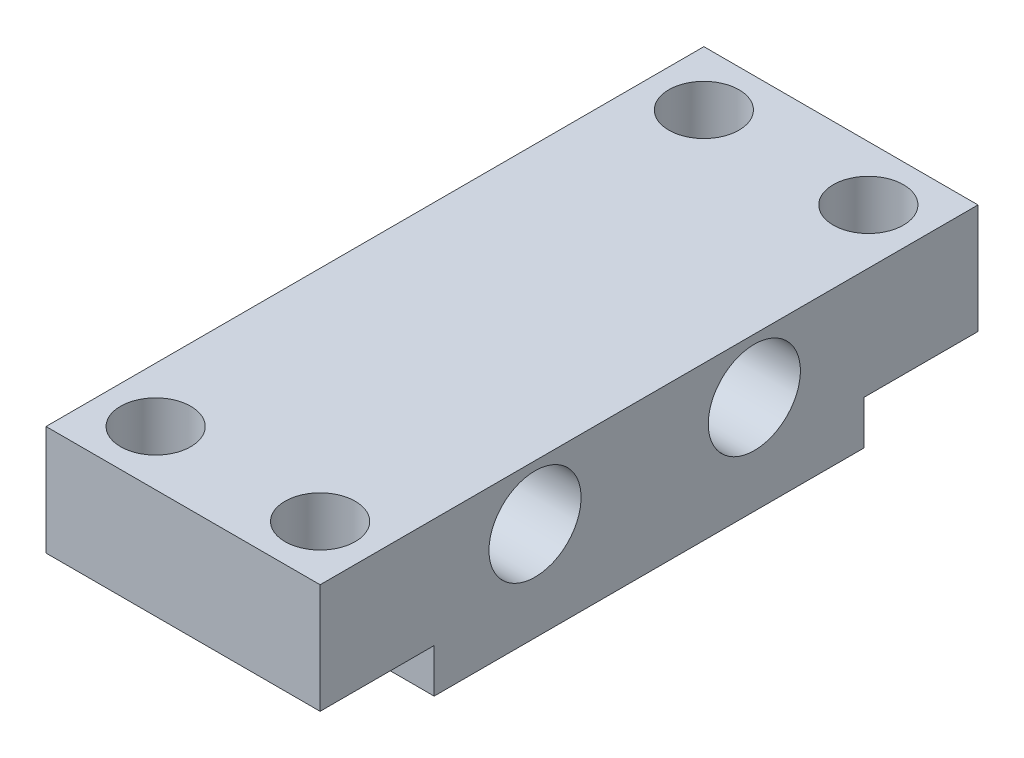
ISO-10303-21;
HEADER;
FILE_DESCRIPTION(('STEP AP214'),'2;1');
FILE_NAME('part.step','',(''),(''),'','','');
FILE_SCHEMA(('AUTOMOTIVE_DESIGN { 1 0 10303 214 1 1 1 1 }'));
ENDSEC;
DATA;
#1=APPLICATION_CONTEXT('core data for automotive mechanical design processes');
#2=APPLICATION_PROTOCOL_DEFINITION('international standard','automotive_design',2000,#1);
#3=PRODUCT_CONTEXT('',#1,'mechanical');
#4=PRODUCT('Part','Part','',(#3));
#5=PRODUCT_RELATED_PRODUCT_CATEGORY('part','',(#4));
#6=PRODUCT_DEFINITION_FORMATION('','',#4);
#7=PRODUCT_DEFINITION_CONTEXT('part definition',#1,'design');
#8=PRODUCT_DEFINITION('design','',#6,#7);
#9=PRODUCT_DEFINITION_SHAPE('','',#8);
#10=(LENGTH_UNIT() NAMED_UNIT(*) SI_UNIT(.MILLI.,.METRE.));
#11=(NAMED_UNIT(*) PLANE_ANGLE_UNIT() SI_UNIT($,.RADIAN.));
#12=(NAMED_UNIT(*) SI_UNIT($,.STERADIAN.) SOLID_ANGLE_UNIT());
#13=UNCERTAINTY_MEASURE_WITH_UNIT(LENGTH_MEASURE(1.E-05),#10,'distance_accuracy_value','');
#14=(GEOMETRIC_REPRESENTATION_CONTEXT(3) GLOBAL_UNCERTAINTY_ASSIGNED_CONTEXT((#13)) GLOBAL_UNIT_ASSIGNED_CONTEXT((#10,
#11,#12)) REPRESENTATION_CONTEXT('',''));
#15=CARTESIAN_POINT('',(0.,0.,0.));
#16=DIRECTION('',(0.,0.,1.));
#17=DIRECTION('',(1.,0.,0.));
#18=AXIS2_PLACEMENT_3D('',#15,#16,#17);
#19=CARTESIAN_POINT('',(0.,0.,0.));
#20=DIRECTION('',(0.,-1.,0.));
#21=DIRECTION('',(0.,0.,-1.));
#22=AXIS2_PLACEMENT_3D('',#19,#20,#21);
#23=PLANE('',#22);
#24=CARTESIAN_POINT('',(10.,0.,-2.5));
#25=DIRECTION('',(0.,-1.,0.));
#26=DIRECTION('',(0.,0.,-1.));
#27=AXIS2_PLACEMENT_3D('',#24,#25,#26);
#28=CIRCLE('',#27,1.6);
#29=CARTESIAN_POINT('',(10.,0.,-4.1));
#30=VERTEX_POINT('',#29);
#31=EDGE_CURVE('E178',#30,#30,#28,.T.);
#32=ORIENTED_EDGE('',*,*,#31,.F.);
#33=EDGE_LOOP('',(#32));
#34=FACE_BOUND('',#33,.T.);
#35=CARTESIAN_POINT('',(2.5,0.,-2.5));
#36=DIRECTION('',(0.,-1.,0.));
#37=DIRECTION('',(0.,0.,-1.));
#38=AXIS2_PLACEMENT_3D('',#35,#36,#37);
#39=CIRCLE('',#38,1.6);
#40=CARTESIAN_POINT('',(2.5,0.,-4.1));
#41=VERTEX_POINT('',#40);
#42=EDGE_CURVE('E165',#41,#41,#39,.T.);
#43=ORIENTED_EDGE('',*,*,#42,.F.);
#44=EDGE_LOOP('',(#43));
#45=FACE_BOUND('',#44,.T.);
#46=DIRECTION('',(-1.,0.,0.));
#47=VECTOR('',#46,1.);
#48=CARTESIAN_POINT('',(0.,0.,-5.2));
#49=LINE('',#48,#47);
#50=CARTESIAN_POINT('',(12.5,0.,-5.2));
#51=VERTEX_POINT('',#50);
#52=CARTESIAN_POINT('',(0.,0.,-5.2));
#53=VERTEX_POINT('',#52);
#54=EDGE_CURVE('E53',#51,#53,#49,.T.);
#55=ORIENTED_EDGE('',*,*,#54,.F.);
#56=DIRECTION('',(0.,0.,-1.));
#57=VECTOR('',#56,1.);
#58=CARTESIAN_POINT('',(12.5,0.,0.));
#59=LINE('',#58,#57);
#60=CARTESIAN_POINT('',(12.5,0.,0.));
#61=VERTEX_POINT('',#60);
#62=EDGE_CURVE('E147',#61,#51,#59,.T.);
#63=ORIENTED_EDGE('',*,*,#62,.F.);
#64=DIRECTION('',(1.,0.,0.));
#65=VECTOR('',#64,1.);
#66=CARTESIAN_POINT('',(0.,0.,0.));
#67=LINE('',#66,#65);
#68=CARTESIAN_POINT('',(0.,0.,0.));
#69=VERTEX_POINT('',#68);
#70=EDGE_CURVE('E144',#69,#61,#67,.T.);
#71=ORIENTED_EDGE('',*,*,#70,.F.);
#72=DIRECTION('',(0.,0.,1.));
#73=VECTOR('',#72,1.);
#74=CARTESIAN_POINT('',(0.,0.,0.));
#75=LINE('',#74,#73);
#76=EDGE_CURVE('E58',#53,#69,#75,.T.);
#77=ORIENTED_EDGE('',*,*,#76,.F.);
#78=EDGE_LOOP('',(#55,#63,#71,#77));
#79=FACE_BOUND('',#78,.T.);
#80=ADVANCED_FACE('F36',(#34,#45,#79),#23,.T.);
#81=CARTESIAN_POINT('',(0.,5.,0.));
#82=DIRECTION('',(1.,0.,0.));
#83=DIRECTION('',(0.,0.,-1.));
#84=AXIS2_PLACEMENT_3D('',#81,#82,#83);
#85=PLANE('',#84);
#86=CARTESIAN_POINT('',(0.,2.5,-19.8));
#87=DIRECTION('',(-1.,0.,0.));
#88=DIRECTION('',(0.,0.,1.));
#89=AXIS2_PLACEMENT_3D('',#86,#87,#88);
#90=CIRCLE('',#89,2.1);
#91=CARTESIAN_POINT('',(0.,2.5,-17.7));
#92=VERTEX_POINT('',#91);
#93=EDGE_CURVE('E160',#92,#92,#90,.T.);
#94=ORIENTED_EDGE('',*,*,#93,.F.);
#95=EDGE_LOOP('',(#94));
#96=FACE_BOUND('',#95,.T.);
#97=CARTESIAN_POINT('',(0.,2.5,-9.8));
#98=DIRECTION('',(-1.,0.,0.));
#99=DIRECTION('',(0.,0.,1.));
#100=AXIS2_PLACEMENT_3D('',#97,#98,#99);
#101=CIRCLE('',#100,2.1);
#102=CARTESIAN_POINT('',(0.,2.5,-7.7));
#103=VERTEX_POINT('',#102);
#104=EDGE_CURVE('E170',#103,#103,#101,.T.);
#105=ORIENTED_EDGE('',*,*,#104,.F.);
#106=EDGE_LOOP('',(#105));
#107=FACE_BOUND('',#106,.T.);
#108=CARTESIAN_POINT('',(0.,0.,-30.));
#109=VERTEX_POINT('',#108);
#110=CARTESIAN_POINT('',(0.,0.,-24.8));
#111=VERTEX_POINT('',#110);
#112=EDGE_CURVE('E126',#109,#111,#75,.T.);
#113=ORIENTED_EDGE('',*,*,#112,.T.);
#114=DIRECTION('',(0.,1.,0.));
#115=VECTOR('',#114,1.);
#116=CARTESIAN_POINT('',(0.,-2.,-24.8));
#117=LINE('',#116,#115);
#118=CARTESIAN_POINT('',(0.,-2.,-24.8));
#119=VERTEX_POINT('',#118);
#120=EDGE_CURVE('E107',#119,#111,#117,.T.);
#121=ORIENTED_EDGE('',*,*,#120,.F.);
#122=DIRECTION('',(0.,0.,-1.));
#123=VECTOR('',#122,1.);
#124=CARTESIAN_POINT('',(0.,-2.,-5.2));
#125=LINE('',#124,#123);
#126=CARTESIAN_POINT('',(0.,-2.,-5.2));
#127=VERTEX_POINT('',#126);
#128=EDGE_CURVE('E113',#127,#119,#125,.T.);
#129=ORIENTED_EDGE('',*,*,#128,.F.);
#130=DIRECTION('',(0.,1.,0.));
#131=VECTOR('',#130,1.);
#132=CARTESIAN_POINT('',(0.,-2.,-5.2));
#133=LINE('',#132,#131);
#134=EDGE_CURVE('E189',#127,#53,#133,.T.);
#135=ORIENTED_EDGE('',*,*,#134,.T.);
#136=ORIENTED_EDGE('',*,*,#76,.T.);
#137=DIRECTION('',(0.,-1.,0.));
#138=VECTOR('',#137,1.);
#139=CARTESIAN_POINT('',(0.,5.,0.));
#140=LINE('',#139,#138);
#141=CARTESIAN_POINT('',(0.,5.,0.));
#142=VERTEX_POINT('',#141);
#143=EDGE_CURVE('E11',#142,#69,#140,.T.);
#144=ORIENTED_EDGE('',*,*,#143,.F.);
#145=DIRECTION('',(0.,0.,1.));
#146=VECTOR('',#145,1.);
#147=CARTESIAN_POINT('',(0.,5.,0.));
#148=LINE('',#147,#146);
#149=CARTESIAN_POINT('',(0.,5.,-30.));
#150=VERTEX_POINT('',#149);
#151=EDGE_CURVE('E133',#150,#142,#148,.T.);
#152=ORIENTED_EDGE('',*,*,#151,.F.);
#153=DIRECTION('',(0.,-1.,0.));
#154=VECTOR('',#153,1.);
#155=CARTESIAN_POINT('',(0.,5.,-30.));
#156=LINE('',#155,#154);
#157=EDGE_CURVE('E142',#150,#109,#156,.T.);
#158=ORIENTED_EDGE('',*,*,#157,.T.);
#159=EDGE_LOOP('',(#113,#121,#129,#135,#136,#144,#152,#158));
#160=FACE_BOUND('',#159,.T.);
#161=ADVANCED_FACE('F38',(#96,#107,#160),#85,.F.);
#162=CARTESIAN_POINT('',(0.,5.,0.));
#163=DIRECTION('',(0.,0.,-1.));
#164=DIRECTION('',(-1.,0.,0.));
#165=AXIS2_PLACEMENT_3D('',#162,#163,#164);
#166=PLANE('',#165);
#167=ORIENTED_EDGE('',*,*,#70,.T.);
#168=DIRECTION('',(0.,-1.,0.));
#169=VECTOR('',#168,1.);
#170=CARTESIAN_POINT('',(12.5,5.,0.));
#171=LINE('',#170,#169);
#172=CARTESIAN_POINT('',(12.5,5.,0.));
#173=VERTEX_POINT('',#172);
#174=EDGE_CURVE('E45',#173,#61,#171,.T.);
#175=ORIENTED_EDGE('',*,*,#174,.F.);
#176=DIRECTION('',(1.,0.,0.));
#177=VECTOR('',#176,1.);
#178=CARTESIAN_POINT('',(0.,5.,0.));
#179=LINE('',#178,#177);
#180=EDGE_CURVE('E136',#142,#173,#179,.T.);
#181=ORIENTED_EDGE('',*,*,#180,.F.);
#182=ORIENTED_EDGE('',*,*,#143,.T.);
#183=EDGE_LOOP('',(#167,#175,#181,#182));
#184=FACE_BOUND('',#183,.T.);
#185=ADVANCED_FACE('F202',(#184),#166,.F.);
#186=CARTESIAN_POINT('',(12.5,5.,0.));
#187=DIRECTION('',(-1.,0.,0.));
#188=DIRECTION('',(0.,0.,1.));
#189=AXIS2_PLACEMENT_3D('',#186,#187,#188);
#190=PLANE('',#189);
#191=CARTESIAN_POINT('',(12.5,2.5,-19.8));
#192=DIRECTION('',(-1.,0.,0.));
#193=DIRECTION('',(0.,0.,1.));
#194=AXIS2_PLACEMENT_3D('',#191,#192,#193);
#195=CIRCLE('',#194,2.1);
#196=CARTESIAN_POINT('',(12.5,2.5,-17.7));
#197=VERTEX_POINT('',#196);
#198=EDGE_CURVE('E159',#197,#197,#195,.T.);
#199=ORIENTED_EDGE('',*,*,#198,.T.);
#200=EDGE_LOOP('',(#199));
#201=FACE_BOUND('',#200,.T.);
#202=CARTESIAN_POINT('',(12.5,2.5,-9.8));
#203=DIRECTION('',(-1.,0.,0.));
#204=DIRECTION('',(0.,0.,1.));
#205=AXIS2_PLACEMENT_3D('',#202,#203,#204);
#206=CIRCLE('',#205,2.1);
#207=CARTESIAN_POINT('',(12.5,2.5,-7.7));
#208=VERTEX_POINT('',#207);
#209=EDGE_CURVE('E156',#208,#208,#206,.T.);
#210=ORIENTED_EDGE('',*,*,#209,.T.);
#211=EDGE_LOOP('',(#210));
#212=FACE_BOUND('',#211,.T.);
#213=ORIENTED_EDGE('',*,*,#62,.T.);
#214=DIRECTION('',(0.,1.,0.));
#215=VECTOR('',#214,1.);
#216=CARTESIAN_POINT('',(12.5,-2.,-5.2));
#217=LINE('',#216,#215);
#218=CARTESIAN_POINT('',(12.5,-2.,-5.2));
#219=VERTEX_POINT('',#218);
#220=EDGE_CURVE('E129',#219,#51,#217,.T.);
#221=ORIENTED_EDGE('',*,*,#220,.F.);
#222=DIRECTION('',(0.,0.,1.));
#223=VECTOR('',#222,1.);
#224=CARTESIAN_POINT('',(12.5,-2.,-5.2));
#225=LINE('',#224,#223);
#226=CARTESIAN_POINT('',(12.5,-2.,-24.8));
#227=VERTEX_POINT('',#226);
#228=EDGE_CURVE('E112',#227,#219,#225,.T.);
#229=ORIENTED_EDGE('',*,*,#228,.F.);
#230=DIRECTION('',(0.,1.,0.));
#231=VECTOR('',#230,1.);
#232=CARTESIAN_POINT('',(12.5,-2.,-24.8));
#233=LINE('',#232,#231);
#234=CARTESIAN_POINT('',(12.5,0.,-24.8));
#235=VERTEX_POINT('',#234);
#236=EDGE_CURVE('E109',#227,#235,#233,.T.);
#237=ORIENTED_EDGE('',*,*,#236,.T.);
#238=CARTESIAN_POINT('',(12.5,0.,-30.));
#239=VERTEX_POINT('',#238);
#240=EDGE_CURVE('E146',#235,#239,#59,.T.);
#241=ORIENTED_EDGE('',*,*,#240,.T.);
#242=DIRECTION('',(0.,-1.,0.));
#243=VECTOR('',#242,1.);
#244=CARTESIAN_POINT('',(12.5,5.,-30.));
#245=LINE('',#244,#243);
#246=CARTESIAN_POINT('',(12.5,5.,-30.));
#247=VERTEX_POINT('',#246);
#248=EDGE_CURVE('E151',#247,#239,#245,.T.);
#249=ORIENTED_EDGE('',*,*,#248,.F.);
#250=DIRECTION('',(0.,0.,-1.));
#251=VECTOR('',#250,1.);
#252=CARTESIAN_POINT('',(12.5,5.,0.));
#253=LINE('',#252,#251);
#254=EDGE_CURVE('E139',#173,#247,#253,.T.);
#255=ORIENTED_EDGE('',*,*,#254,.F.);
#256=ORIENTED_EDGE('',*,*,#174,.T.);
#257=EDGE_LOOP('',(#213,#221,#229,#237,#241,#249,#255,#256));
#258=FACE_BOUND('',#257,.T.);
#259=ADVANCED_FACE('F197',(#201,#212,#258),#190,.F.);
#260=CARTESIAN_POINT('',(0.,5.,-30.));
#261=DIRECTION('',(0.,0.,1.));
#262=DIRECTION('',(1.,0.,0.));
#263=AXIS2_PLACEMENT_3D('',#260,#261,#262);
#264=PLANE('',#263);
#265=DIRECTION('',(-1.,0.,0.));
#266=VECTOR('',#265,1.);
#267=CARTESIAN_POINT('',(0.,0.,-30.));
#268=LINE('',#267,#266);
#269=EDGE_CURVE('E137',#239,#109,#268,.T.);
#270=ORIENTED_EDGE('',*,*,#269,.T.);
#271=ORIENTED_EDGE('',*,*,#157,.F.);
#272=DIRECTION('',(-1.,0.,0.));
#273=VECTOR('',#272,1.);
#274=CARTESIAN_POINT('',(0.,5.,-30.));
#275=LINE('',#274,#273);
#276=EDGE_CURVE('E141',#247,#150,#275,.T.);
#277=ORIENTED_EDGE('',*,*,#276,.F.);
#278=ORIENTED_EDGE('',*,*,#248,.T.);
#279=EDGE_LOOP('',(#270,#271,#277,#278));
#280=FACE_BOUND('',#279,.T.);
#281=ADVANCED_FACE('F210',(#280),#264,.F.);
#282=CARTESIAN_POINT('',(0.,5.,0.));
#283=DIRECTION('',(0.,-1.,0.));
#284=DIRECTION('',(0.,0.,-1.));
#285=AXIS2_PLACEMENT_3D('',#282,#283,#284);
#286=PLANE('',#285);
#287=CARTESIAN_POINT('',(10.,5.,-27.5));
#288=DIRECTION('',(0.,1.,0.));
#289=DIRECTION('',(0.,0.,1.));
#290=AXIS2_PLACEMENT_3D('',#287,#288,#289);
#291=CIRCLE('',#290,1.6);
#292=CARTESIAN_POINT('',(10.,5.,-25.9));
#293=VERTEX_POINT('',#292);
#294=EDGE_CURVE('E333',#293,#293,#291,.T.);
#295=ORIENTED_EDGE('',*,*,#294,.F.);
#296=EDGE_LOOP('',(#295));
#297=FACE_BOUND('',#296,.T.);
#298=CARTESIAN_POINT('',(10.,5.,-2.5));
#299=DIRECTION('',(0.,1.,0.));
#300=DIRECTION('',(0.,0.,1.));
#301=AXIS2_PLACEMENT_3D('',#298,#299,#300);
#302=CIRCLE('',#301,1.6);
#303=CARTESIAN_POINT('',(10.,5.,-0.899999999999998));
#304=VERTEX_POINT('',#303);
#305=EDGE_CURVE('E331',#304,#304,#302,.T.);
#306=ORIENTED_EDGE('',*,*,#305,.F.);
#307=EDGE_LOOP('',(#306));
#308=FACE_BOUND('',#307,.T.);
#309=CARTESIAN_POINT('',(2.5,5.,-27.5));
#310=DIRECTION('',(0.,1.,0.));
#311=DIRECTION('',(0.,0.,1.));
#312=AXIS2_PLACEMENT_3D('',#309,#310,#311);
#313=CIRCLE('',#312,1.6);
#314=CARTESIAN_POINT('',(2.5,5.,-25.9));
#315=VERTEX_POINT('',#314);
#316=EDGE_CURVE('E166',#315,#315,#313,.T.);
#317=ORIENTED_EDGE('',*,*,#316,.F.);
#318=EDGE_LOOP('',(#317));
#319=FACE_BOUND('',#318,.T.);
#320=CARTESIAN_POINT('',(2.5,5.,-2.5));
#321=DIRECTION('',(0.,1.,0.));
#322=DIRECTION('',(0.,0.,1.));
#323=AXIS2_PLACEMENT_3D('',#320,#321,#322);
#324=CIRCLE('',#323,1.6);
#325=CARTESIAN_POINT('',(2.5,5.,-0.899999999999998));
#326=VERTEX_POINT('',#325);
#327=EDGE_CURVE('E173',#326,#326,#324,.T.);
#328=ORIENTED_EDGE('',*,*,#327,.F.);
#329=EDGE_LOOP('',(#328));
#330=FACE_BOUND('',#329,.T.);
#331=ORIENTED_EDGE('',*,*,#151,.T.);
#332=ORIENTED_EDGE('',*,*,#180,.T.);
#333=ORIENTED_EDGE('',*,*,#254,.T.);
#334=ORIENTED_EDGE('',*,*,#276,.T.);
#335=EDGE_LOOP('',(#331,#332,#333,#334));
#336=FACE_BOUND('',#335,.T.);
#337=ADVANCED_FACE('F206',(#297,#308,#319,#330,#336),#286,.F.);
#338=CARTESIAN_POINT('',(10.,0.,-27.5));
#339=DIRECTION('',(0.,-1.,0.));
#340=DIRECTION('',(0.,0.,-1.));
#341=AXIS2_PLACEMENT_3D('',#338,#339,#340);
#342=CIRCLE('',#341,1.6);
#343=CARTESIAN_POINT('',(10.,0.,-29.1));
#344=VERTEX_POINT('',#343);
#345=EDGE_CURVE('E40',#344,#344,#342,.T.);
#346=ORIENTED_EDGE('',*,*,#345,.F.);
#347=EDGE_LOOP('',(#346));
#348=FACE_BOUND('',#347,.T.);
#349=CARTESIAN_POINT('',(2.5,0.,-27.5));
#350=DIRECTION('',(0.,-1.,0.));
#351=DIRECTION('',(0.,0.,-1.));
#352=AXIS2_PLACEMENT_3D('',#349,#350,#351);
#353=CIRCLE('',#352,1.6);
#354=CARTESIAN_POINT('',(2.5,0.,-29.1));
#355=VERTEX_POINT('',#354);
#356=EDGE_CURVE('E163',#355,#355,#353,.T.);
#357=ORIENTED_EDGE('',*,*,#356,.F.);
#358=EDGE_LOOP('',(#357));
#359=FACE_BOUND('',#358,.T.);
#360=DIRECTION('',(1.,0.,0.));
#361=VECTOR('',#360,1.);
#362=CARTESIAN_POINT('',(0.,0.,-24.8));
#363=LINE('',#362,#361);
#364=EDGE_CURVE('E162',#111,#235,#363,.T.);
#365=ORIENTED_EDGE('',*,*,#364,.F.);
#366=ORIENTED_EDGE('',*,*,#112,.F.);
#367=ORIENTED_EDGE('',*,*,#269,.F.);
#368=ORIENTED_EDGE('',*,*,#240,.F.);
#369=EDGE_LOOP('',(#365,#366,#367,#368));
#370=FACE_BOUND('',#369,.T.);
#371=ADVANCED_FACE('F213',(#348,#359,#370),#23,.T.);
#372=CARTESIAN_POINT('',(0.,-2.,-24.8));
#373=DIRECTION('',(0.,0.,1.));
#374=DIRECTION('',(1.,0.,0.));
#375=AXIS2_PLACEMENT_3D('',#372,#373,#374);
#376=PLANE('',#375);
#377=ORIENTED_EDGE('',*,*,#364,.T.);
#378=ORIENTED_EDGE('',*,*,#236,.F.);
#379=DIRECTION('',(1.,0.,0.));
#380=VECTOR('',#379,1.);
#381=CARTESIAN_POINT('',(0.,-2.,-24.8));
#382=LINE('',#381,#380);
#383=EDGE_CURVE('E102',#119,#227,#382,.T.);
#384=ORIENTED_EDGE('',*,*,#383,.F.);
#385=ORIENTED_EDGE('',*,*,#120,.T.);
#386=EDGE_LOOP('',(#377,#378,#384,#385));
#387=FACE_BOUND('',#386,.T.);
#388=ADVANCED_FACE('F105',(#387),#376,.F.);
#389=CARTESIAN_POINT('',(0.,-2.,-5.2));
#390=DIRECTION('',(0.,0.,-1.));
#391=DIRECTION('',(-1.,0.,0.));
#392=AXIS2_PLACEMENT_3D('',#389,#390,#391);
#393=PLANE('',#392);
#394=ORIENTED_EDGE('',*,*,#54,.T.);
#395=ORIENTED_EDGE('',*,*,#134,.F.);
#396=DIRECTION('',(-1.,0.,0.));
#397=VECTOR('',#396,1.);
#398=CARTESIAN_POINT('',(0.,-2.,-5.2));
#399=LINE('',#398,#397);
#400=EDGE_CURVE('E118',#219,#127,#399,.T.);
#401=ORIENTED_EDGE('',*,*,#400,.F.);
#402=ORIENTED_EDGE('',*,*,#220,.T.);
#403=EDGE_LOOP('',(#394,#395,#401,#402));
#404=FACE_BOUND('',#403,.T.);
#405=ADVANCED_FACE('F195',(#404),#393,.F.);
#406=CARTESIAN_POINT('',(0.,-2.,0.));
#407=DIRECTION('',(0.,-1.,0.));
#408=DIRECTION('',(0.,0.,-1.));
#409=AXIS2_PLACEMENT_3D('',#406,#407,#408);
#410=PLANE('',#409);
#411=ORIENTED_EDGE('',*,*,#128,.T.);
#412=ORIENTED_EDGE('',*,*,#383,.T.);
#413=ORIENTED_EDGE('',*,*,#228,.T.);
#414=ORIENTED_EDGE('',*,*,#400,.T.);
#415=EDGE_LOOP('',(#411,#412,#413,#414));
#416=FACE_BOUND('',#415,.T.);
#417=ADVANCED_FACE('F116',(#416),#410,.T.);
#418=CARTESIAN_POINT('',(15.,2.5,-9.8));
#419=DIRECTION('',(-1.,0.,0.));
#420=DIRECTION('',(0.,0.,1.));
#421=AXIS2_PLACEMENT_3D('',#418,#419,#420);
#422=CYLINDRICAL_SURFACE('',#421,2.1);
#423=ORIENTED_EDGE('',*,*,#104,.T.);
#424=EDGE_LOOP('',(#423));
#425=FACE_BOUND('',#424,.T.);
#426=ORIENTED_EDGE('',*,*,#209,.F.);
#427=EDGE_LOOP('',(#426));
#428=FACE_BOUND('',#427,.T.);
#429=ADVANCED_FACE('F259',(#425,#428),#422,.F.);
#430=CARTESIAN_POINT('',(15.,2.5,-19.8));
#431=DIRECTION('',(-1.,0.,0.));
#432=DIRECTION('',(0.,0.,1.));
#433=AXIS2_PLACEMENT_3D('',#430,#431,#432);
#434=CYLINDRICAL_SURFACE('',#433,2.1);
#435=ORIENTED_EDGE('',*,*,#93,.T.);
#436=EDGE_LOOP('',(#435));
#437=FACE_BOUND('',#436,.T.);
#438=ORIENTED_EDGE('',*,*,#198,.F.);
#439=EDGE_LOOP('',(#438));
#440=FACE_BOUND('',#439,.T.);
#441=ADVANCED_FACE('F253',(#437,#440),#434,.F.);
#442=CARTESIAN_POINT('',(2.5,-5.,-27.5));
#443=DIRECTION('',(0.,1.,0.));
#444=DIRECTION('',(0.,0.,1.));
#445=AXIS2_PLACEMENT_3D('',#442,#443,#444);
#446=CYLINDRICAL_SURFACE('',#445,1.6);
#447=ORIENTED_EDGE('',*,*,#356,.T.);
#448=EDGE_LOOP('',(#447));
#449=FACE_BOUND('',#448,.T.);
#450=ORIENTED_EDGE('',*,*,#316,.T.);
#451=EDGE_LOOP('',(#450));
#452=FACE_BOUND('',#451,.T.);
#453=ADVANCED_FACE('F242',(#449,#452),#446,.F.);
#454=CARTESIAN_POINT('',(2.5,-5.,-2.5));
#455=DIRECTION('',(0.,1.,0.));
#456=DIRECTION('',(0.,0.,1.));
#457=AXIS2_PLACEMENT_3D('',#454,#455,#456);
#458=CYLINDRICAL_SURFACE('',#457,1.6);
#459=ORIENTED_EDGE('',*,*,#42,.T.);
#460=EDGE_LOOP('',(#459));
#461=FACE_BOUND('',#460,.T.);
#462=ORIENTED_EDGE('',*,*,#327,.T.);
#463=EDGE_LOOP('',(#462));
#464=FACE_BOUND('',#463,.T.);
#465=ADVANCED_FACE('F238',(#461,#464),#458,.F.);
#466=CARTESIAN_POINT('',(10.,-5.,-27.5));
#467=DIRECTION('',(0.,1.,0.));
#468=DIRECTION('',(0.,0.,1.));
#469=AXIS2_PLACEMENT_3D('',#466,#467,#468);
#470=CYLINDRICAL_SURFACE('',#469,1.6);
#471=ORIENTED_EDGE('',*,*,#345,.T.);
#472=EDGE_LOOP('',(#471));
#473=FACE_BOUND('',#472,.T.);
#474=ORIENTED_EDGE('',*,*,#294,.T.);
#475=EDGE_LOOP('',(#474));
#476=FACE_BOUND('',#475,.T.);
#477=ADVANCED_FACE('F241',(#473,#476),#470,.F.);
#478=CARTESIAN_POINT('',(10.,-5.,-2.5));
#479=DIRECTION('',(0.,1.,0.));
#480=DIRECTION('',(0.,0.,1.));
#481=AXIS2_PLACEMENT_3D('',#478,#479,#480);
#482=CYLINDRICAL_SURFACE('',#481,1.6);
#483=ORIENTED_EDGE('',*,*,#31,.T.);
#484=EDGE_LOOP('',(#483));
#485=FACE_BOUND('',#484,.T.);
#486=ORIENTED_EDGE('',*,*,#305,.T.);
#487=EDGE_LOOP('',(#486));
#488=FACE_BOUND('',#487,.T.);
#489=ADVANCED_FACE('F250',(#485,#488),#482,.F.);
#490=CLOSED_SHELL('',(#80,#161,#185,#259,#281,#337,#371,#388,#405,#417,#429,#441,#453,#465,#477,#489));
#491=MANIFOLD_SOLID_BREP('B2',#490);
#492=ADVANCED_BREP_SHAPE_REPRESENTATION('',(#18,#491),#14);
#493=SHAPE_DEFINITION_REPRESENTATION(#9,#492);
ENDSEC;
END-ISO-10303-21;
